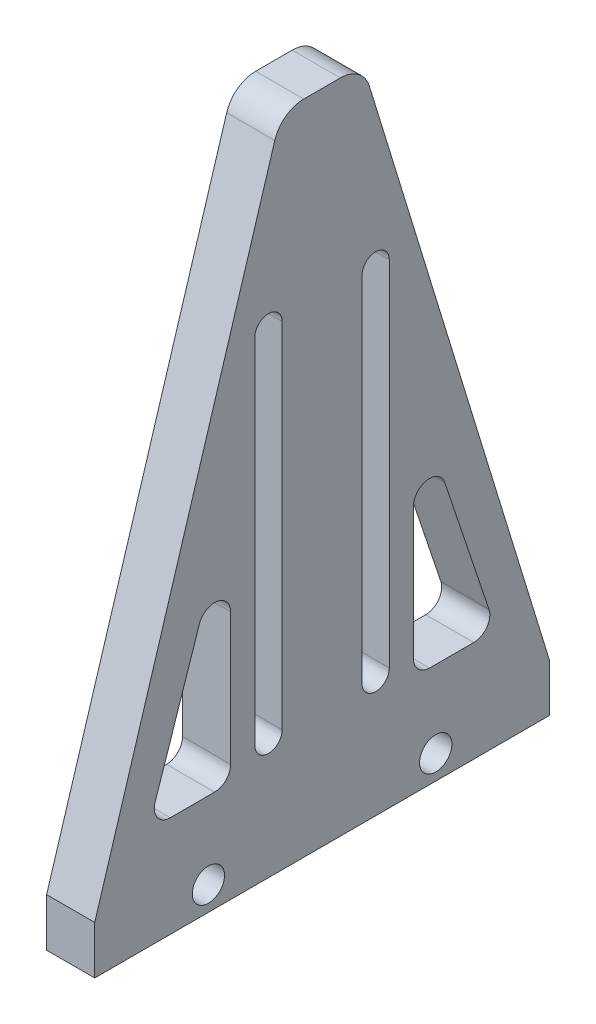
ISO-10303-21;
HEADER;
FILE_DESCRIPTION(('STEP AP214'),'2;1');
FILE_NAME('part.step','',(''),(''),'','','');
FILE_SCHEMA(('AUTOMOTIVE_DESIGN { 1 0 10303 214 1 1 1 1 }'));
ENDSEC;
DATA;
#1=APPLICATION_CONTEXT('core data for automotive mechanical design processes');
#2=APPLICATION_PROTOCOL_DEFINITION('international standard','automotive_design',2000,#1);
#3=PRODUCT_CONTEXT('',#1,'mechanical');
#4=PRODUCT('Part','Part','',(#3));
#5=PRODUCT_RELATED_PRODUCT_CATEGORY('part','',(#4));
#6=PRODUCT_DEFINITION_FORMATION('','',#4);
#7=PRODUCT_DEFINITION_CONTEXT('part definition',#1,'design');
#8=PRODUCT_DEFINITION('design','',#6,#7);
#9=PRODUCT_DEFINITION_SHAPE('','',#8);
#10=(LENGTH_UNIT() NAMED_UNIT(*) SI_UNIT(.MILLI.,.METRE.));
#11=(NAMED_UNIT(*) PLANE_ANGLE_UNIT() SI_UNIT($,.RADIAN.));
#12=(NAMED_UNIT(*) SI_UNIT($,.STERADIAN.) SOLID_ANGLE_UNIT());
#13=UNCERTAINTY_MEASURE_WITH_UNIT(LENGTH_MEASURE(1.E-05),#10,'distance_accuracy_value','');
#14=(GEOMETRIC_REPRESENTATION_CONTEXT(3) GLOBAL_UNCERTAINTY_ASSIGNED_CONTEXT((#13)) GLOBAL_UNIT_ASSIGNED_CONTEXT((#10,
#11,#12)) REPRESENTATION_CONTEXT('',''));
#15=CARTESIAN_POINT('',(0.,0.,0.));
#16=DIRECTION('',(0.,0.,1.));
#17=DIRECTION('',(1.,0.,0.));
#18=AXIS2_PLACEMENT_3D('',#15,#16,#17);
#19=CARTESIAN_POINT('',(2.3815,62.,1.809725066952));
#20=DIRECTION('',(1.,0.,0.));
#21=DIRECTION('',(0.,0.,-1.));
#22=AXIS2_PLACEMENT_3D('',#19,#20,#21);
#23=PLANE('',#22);
#24=CARTESIAN_POINT('',(2.3815,2.38149999999999,11.25));
#25=DIRECTION('',(1.,0.,0.));
#26=DIRECTION('',(0.,0.,-1.));
#27=AXIS2_PLACEMENT_3D('',#24,#25,#26);
#28=CIRCLE('',#27,1.6);
#29=CARTESIAN_POINT('',(2.3815,2.38149999999999,9.65));
#30=VERTEX_POINT('',#29);
#31=EDGE_CURVE('E1065',#30,#30,#28,.T.);
#32=ORIENTED_EDGE('',*,*,#31,.F.);
#33=EDGE_LOOP('',(#32));
#34=FACE_BOUND('',#33,.T.);
#35=CARTESIAN_POINT('',(2.3815,2.38149999999999,-11.25));
#36=DIRECTION('',(1.,0.,0.));
#37=DIRECTION('',(0.,0.,-1.));
#38=AXIS2_PLACEMENT_3D('',#35,#36,#37);
#39=CIRCLE('',#38,1.6);
#40=CARTESIAN_POINT('',(2.3815,2.38149999999999,-12.85));
#41=VERTEX_POINT('',#40);
#42=EDGE_CURVE('E1062',#41,#41,#39,.T.);
#43=ORIENTED_EDGE('',*,*,#42,.F.);
#44=EDGE_LOOP('',(#43));
#45=FACE_BOUND('',#44,.T.);
#46=DIRECTION('',(0.,-0.948109953692156,0.317942629588826));
#47=VECTOR('',#46,1.);
#48=CARTESIAN_POINT('',(2.3815,25.1645764791513,12.1383518735185));
#49=LINE('',#48,#47);
#50=CARTESIAN_POINT('',(2.3815,25.1645764791513,12.1383518735185));
#51=VERTEX_POINT('',#50);
#52=CARTESIAN_POINT('',(2.3815,12.0922339244723,16.5220786243402));
#53=VERTEX_POINT('',#52);
#54=EDGE_CURVE('E782',#51,#53,#49,.T.);
#55=ORIENTED_EDGE('',*,*,#54,.F.);
#56=CARTESIAN_POINT('',(2.3815,24.659842554679,10.6332273220322));
#57=DIRECTION('',(1.,0.,0.));
#58=DIRECTION('',(0.,0.,-1.));
#59=AXIS2_PLACEMENT_3D('',#56,#57,#58);
#60=CIRCLE('',#59,1.5875);
#61=CARTESIAN_POINT('',(2.3815,24.659842554679,9.04572732203224));
#62=VERTEX_POINT('',#61);
#63=EDGE_CURVE('E780',#62,#51,#60,.T.);
#64=ORIENTED_EDGE('',*,*,#63,.F.);
#65=DIRECTION('',(0.,1.,0.));
#66=VECTOR('',#65,1.);
#67=CARTESIAN_POINT('',(2.3815,24.659842554679,9.04572732203224));
#68=LINE('',#67,#66);
#69=CARTESIAN_POINT('',(2.3815,11.5875,9.04572732203223));
#70=VERTEX_POINT('',#69);
#71=EDGE_CURVE('E792',#70,#62,#68,.T.);
#72=ORIENTED_EDGE('',*,*,#71,.F.);
#73=CARTESIAN_POINT('',(2.3815,11.5875,10.6332273220322));
#74=DIRECTION('',(1.,0.,0.));
#75=DIRECTION('',(0.,0.,-1.));
#76=AXIS2_PLACEMENT_3D('',#73,#74,#75);
#77=CIRCLE('',#76,1.5875);
#78=CARTESIAN_POINT('',(2.3815,10.,10.6332273220322));
#79=VERTEX_POINT('',#78);
#80=EDGE_CURVE('E789',#79,#70,#77,.T.);
#81=ORIENTED_EDGE('',*,*,#80,.F.);
#82=DIRECTION('',(0.,0.,-1.));
#83=VECTOR('',#82,1.);
#84=CARTESIAN_POINT('',(2.3815,10.,15.0169540728539));
#85=LINE('',#84,#83);
#86=CARTESIAN_POINT('',(2.3815,10.,15.0169540728539));
#87=VERTEX_POINT('',#86);
#88=EDGE_CURVE('E787',#87,#79,#85,.T.);
#89=ORIENTED_EDGE('',*,*,#88,.F.);
#90=CARTESIAN_POINT('',(2.3815,11.5875,15.0169540728539));
#91=DIRECTION('',(1.,0.,0.));
#92=DIRECTION('',(0.,0.,1.));
#93=AXIS2_PLACEMENT_3D('',#90,#91,#92);
#94=CIRCLE('',#93,1.5875);
#95=EDGE_CURVE('E785',#53,#87,#94,.T.);
#96=ORIENTED_EDGE('',*,*,#95,.F.);
#97=EDGE_LOOP('',(#55,#64,#72,#81,#89,#96));
#98=FACE_BOUND('',#97,.T.);
#99=DIRECTION('',(0.,-1.,0.));
#100=VECTOR('',#99,1.);
#101=CARTESIAN_POINT('',(2.3815,47.,6.6550085664508));
#102=LINE('',#101,#100);
#103=CARTESIAN_POINT('',(2.3815,47.,6.6550085664508));
#104=VERTEX_POINT('',#103);
#105=CARTESIAN_POINT('',(2.3815,12.,6.65500856645079));
#106=VERTEX_POINT('',#105);
#107=EDGE_CURVE('E916',#104,#106,#102,.T.);
#108=ORIENTED_EDGE('',*,*,#107,.F.);
#109=CARTESIAN_POINT('',(2.3815,47.,5.3050085664508));
#110=DIRECTION('',(1.,0.,0.));
#111=DIRECTION('',(0.,0.,-1.));
#112=AXIS2_PLACEMENT_3D('',#109,#110,#111);
#113=CIRCLE('',#112,1.35);
#114=CARTESIAN_POINT('',(2.3815,47.,3.9550085664508));
#115=VERTEX_POINT('',#114);
#116=EDGE_CURVE('E914',#115,#104,#113,.T.);
#117=ORIENTED_EDGE('',*,*,#116,.F.);
#118=DIRECTION('',(0.,1.,0.));
#119=VECTOR('',#118,1.);
#120=CARTESIAN_POINT('',(2.3815,47.,3.9550085664508));
#121=LINE('',#120,#119);
#122=CARTESIAN_POINT('',(2.3815,12.,3.9550085664508));
#123=VERTEX_POINT('',#122);
#124=EDGE_CURVE('E839',#123,#115,#121,.T.);
#125=ORIENTED_EDGE('',*,*,#124,.F.);
#126=CARTESIAN_POINT('',(2.3815,12.,5.30500856645079));
#127=DIRECTION('',(1.,0.,0.));
#128=DIRECTION('',(0.,0.,-1.));
#129=AXIS2_PLACEMENT_3D('',#126,#127,#128);
#130=CIRCLE('',#129,1.35);
#131=EDGE_CURVE('E917',#106,#123,#130,.T.);
#132=ORIENTED_EDGE('',*,*,#131,.F.);
#133=EDGE_LOOP('',(#108,#117,#125,#132));
#134=FACE_BOUND('',#133,.T.);
#135=DIRECTION('',(0.,-1.,0.));
#136=VECTOR('',#135,1.);
#137=CARTESIAN_POINT('',(2.3815,0.,22.5));
#138=LINE('',#137,#136);
#139=CARTESIAN_POINT('',(2.3815,4.763,22.5));
#140=VERTEX_POINT('',#139);
#141=CARTESIAN_POINT('',(2.3815,0.,22.5));
#142=VERTEX_POINT('',#141);
#143=EDGE_CURVE('E936',#140,#142,#138,.T.);
#144=ORIENTED_EDGE('',*,*,#143,.T.);
#145=DIRECTION('',(0.,0.,-1.));
#146=VECTOR('',#145,1.);
#147=CARTESIAN_POINT('',(2.3815,0.,22.5));
#148=LINE('',#147,#146);
#149=CARTESIAN_POINT('',(2.3815,0.,-22.5));
#150=VERTEX_POINT('',#149);
#151=EDGE_CURVE('E939',#142,#150,#148,.T.);
#152=ORIENTED_EDGE('',*,*,#151,.T.);
#153=DIRECTION('',(0.,1.,0.));
#154=VECTOR('',#153,1.);
#155=CARTESIAN_POINT('',(2.3815,0.,-22.5));
#156=LINE('',#155,#154);
#157=CARTESIAN_POINT('',(2.3815,4.763,-22.5));
#158=VERTEX_POINT('',#157);
#159=EDGE_CURVE('E942',#150,#158,#156,.T.);
#160=ORIENTED_EDGE('',*,*,#159,.T.);
#161=DIRECTION('',(0.,0.956055602855064,0.293185409339278));
#162=VECTOR('',#161,1.);
#163=CARTESIAN_POINT('',(2.3815,4.763,-22.5));
#164=LINE('',#163,#162);
#165=CARTESIAN_POINT('',(2.3815,62.8795562280178,-4.6778918755172));
#166=VERTEX_POINT('',#165);
#167=EDGE_CURVE('E944',#158,#166,#164,.T.);
#168=ORIENTED_EDGE('',*,*,#167,.T.);
#169=CARTESIAN_POINT('',(2.3815,62.,-1.809725066952));
#170=DIRECTION('',(1.,0.,0.));
#171=DIRECTION('',(0.,0.,1.));
#172=AXIS2_PLACEMENT_3D('',#169,#170,#171);
#173=CIRCLE('',#172,3.);
#174=CARTESIAN_POINT('',(2.3815,65.,-1.809725066952));
#175=VERTEX_POINT('',#174);
#176=EDGE_CURVE('E946',#166,#175,#173,.T.);
#177=ORIENTED_EDGE('',*,*,#176,.T.);
#178=DIRECTION('',(0.,0.,1.));
#179=VECTOR('',#178,1.);
#180=CARTESIAN_POINT('',(2.3815,65.,1.809725066952));
#181=LINE('',#180,#179);
#182=CARTESIAN_POINT('',(2.3815,65.,1.809725066952));
#183=VERTEX_POINT('',#182);
#184=EDGE_CURVE('E948',#175,#183,#181,.T.);
#185=ORIENTED_EDGE('',*,*,#184,.T.);
#186=CARTESIAN_POINT('',(2.3815,62.,1.809725066952));
#187=DIRECTION('',(1.,0.,0.));
#188=DIRECTION('',(0.,0.,-1.));
#189=AXIS2_PLACEMENT_3D('',#186,#187,#188);
#190=CIRCLE('',#189,3.);
#191=CARTESIAN_POINT('',(2.3815,62.8795562280178,4.6778918755172));
#192=VERTEX_POINT('',#191);
#193=EDGE_CURVE('E949',#183,#192,#190,.T.);
#194=ORIENTED_EDGE('',*,*,#193,.T.);
#195=DIRECTION('',(0.,-0.956055602855064,0.293185409339278));
#196=VECTOR('',#195,1.);
#197=CARTESIAN_POINT('',(2.3815,62.8795562280178,4.6778918755172));
#198=LINE('',#197,#196);
#199=EDGE_CURVE('E867',#192,#140,#198,.T.);
#200=ORIENTED_EDGE('',*,*,#199,.T.);
#201=EDGE_LOOP('',(#144,#152,#160,#168,#177,#185,#194,#200));
#202=FACE_BOUND('',#201,.T.);
#203=DIRECTION('',(0.,-1.,0.));
#204=VECTOR('',#203,1.);
#205=CARTESIAN_POINT('',(2.3815,47.,-3.95500856645079));
#206=LINE('',#205,#204);
#207=CARTESIAN_POINT('',(2.3815,47.,-3.95500856645079));
#208=VERTEX_POINT('',#207);
#209=CARTESIAN_POINT('',(2.3815,12.,-3.95500856645079));
#210=VERTEX_POINT('',#209);
#211=EDGE_CURVE('E1026',#208,#210,#206,.T.);
#212=ORIENTED_EDGE('',*,*,#211,.F.);
#213=CARTESIAN_POINT('',(2.3815,47.,-5.30500856645079));
#214=DIRECTION('',(1.,0.,0.));
#215=DIRECTION('',(0.,0.,-1.));
#216=AXIS2_PLACEMENT_3D('',#213,#214,#215);
#217=CIRCLE('',#216,1.35);
#218=CARTESIAN_POINT('',(2.3815,47.,-6.65500856645079));
#219=VERTEX_POINT('',#218);
#220=EDGE_CURVE('E904',#219,#208,#217,.T.);
#221=ORIENTED_EDGE('',*,*,#220,.F.);
#222=DIRECTION('',(0.,1.,0.));
#223=VECTOR('',#222,1.);
#224=CARTESIAN_POINT('',(2.3815,47.,-6.65500856645079));
#225=LINE('',#224,#223);
#226=CARTESIAN_POINT('',(2.3815,12.,-6.65500856645079));
#227=VERTEX_POINT('',#226);
#228=EDGE_CURVE('E889',#227,#219,#225,.T.);
#229=ORIENTED_EDGE('',*,*,#228,.F.);
#230=CARTESIAN_POINT('',(2.3815,12.,-5.30500856645079));
#231=DIRECTION('',(1.,0.,0.));
#232=DIRECTION('',(0.,0.,-1.));
#233=AXIS2_PLACEMENT_3D('',#230,#231,#232);
#234=CIRCLE('',#233,1.35);
#235=EDGE_CURVE('E1029',#210,#227,#234,.T.);
#236=ORIENTED_EDGE('',*,*,#235,.F.);
#237=EDGE_LOOP('',(#212,#221,#229,#236));
#238=FACE_BOUND('',#237,.T.);
#239=DIRECTION('',(0.,0.948109953692156,0.317942629588826));
#240=VECTOR('',#239,1.);
#241=CARTESIAN_POINT('',(2.3815,25.1645764791513,-12.1383518735185));
#242=LINE('',#241,#240);
#243=CARTESIAN_POINT('',(2.3815,12.0922339244723,-16.5220786243401));
#244=VERTEX_POINT('',#243);
#245=CARTESIAN_POINT('',(2.3815,25.1645764791513,-12.1383518735185));
#246=VERTEX_POINT('',#245);
#247=EDGE_CURVE('E237',#244,#246,#242,.T.);
#248=ORIENTED_EDGE('',*,*,#247,.F.);
#249=CARTESIAN_POINT('',(2.3815,11.5875,-15.0169540728538));
#250=DIRECTION('',(1.,0.,0.));
#251=DIRECTION('',(0.,0.,-1.));
#252=AXIS2_PLACEMENT_3D('',#249,#250,#251);
#253=CIRCLE('',#252,1.5875);
#254=CARTESIAN_POINT('',(2.3815,10.,-15.0169540728538));
#255=VERTEX_POINT('',#254);
#256=EDGE_CURVE('E229',#255,#244,#253,.T.);
#257=ORIENTED_EDGE('',*,*,#256,.F.);
#258=DIRECTION('',(0.,0.,-1.));
#259=VECTOR('',#258,1.);
#260=CARTESIAN_POINT('',(2.3815,10.,-15.0169540728538));
#261=LINE('',#260,#259);
#262=CARTESIAN_POINT('',(2.3815,10.,-10.6332273220322));
#263=VERTEX_POINT('',#262);
#264=EDGE_CURVE('E259',#263,#255,#261,.T.);
#265=ORIENTED_EDGE('',*,*,#264,.F.);
#266=CARTESIAN_POINT('',(2.3815,11.5875,-10.6332273220322));
#267=DIRECTION('',(1.,0.,0.));
#268=DIRECTION('',(0.,0.,1.));
#269=AXIS2_PLACEMENT_3D('',#266,#267,#268);
#270=CIRCLE('',#269,1.5875);
#271=CARTESIAN_POINT('',(2.3815,11.5875,-9.04572732203222));
#272=VERTEX_POINT('',#271);
#273=EDGE_CURVE('E257',#272,#263,#270,.T.);
#274=ORIENTED_EDGE('',*,*,#273,.F.);
#275=DIRECTION('',(0.,-1.,0.));
#276=VECTOR('',#275,1.);
#277=CARTESIAN_POINT('',(2.3815,24.659842554679,-9.04572732203223));
#278=LINE('',#277,#276);
#279=CARTESIAN_POINT('',(2.3815,24.659842554679,-9.04572732203223));
#280=VERTEX_POINT('',#279);
#281=EDGE_CURVE('E252',#280,#272,#278,.T.);
#282=ORIENTED_EDGE('',*,*,#281,.F.);
#283=CARTESIAN_POINT('',(2.3815,24.659842554679,-10.6332273220322));
#284=DIRECTION('',(1.,0.,0.));
#285=DIRECTION('',(0.,0.,1.));
#286=AXIS2_PLACEMENT_3D('',#283,#284,#285);
#287=CIRCLE('',#286,1.5875);
#288=EDGE_CURVE('E250',#246,#280,#287,.T.);
#289=ORIENTED_EDGE('',*,*,#288,.F.);
#290=EDGE_LOOP('',(#248,#257,#265,#274,#282,#289));
#291=FACE_BOUND('',#290,.T.);
#292=ADVANCED_FACE('F44',(#34,#45,#98,#134,#202,#238,#291),#23,.T.);
#293=CARTESIAN_POINT('',(-2.3815,62.,1.809725066952));
#294=DIRECTION('',(1.,0.,0.));
#295=DIRECTION('',(0.,0.,-1.));
#296=AXIS2_PLACEMENT_3D('',#293,#294,#295);
#297=PLANE('',#296);
#298=CARTESIAN_POINT('',(-2.3815,2.38149999999999,11.25));
#299=DIRECTION('',(1.,0.,0.));
#300=DIRECTION('',(0.,0.,-1.));
#301=AXIS2_PLACEMENT_3D('',#298,#299,#300);
#302=CIRCLE('',#301,1.6);
#303=CARTESIAN_POINT('',(-2.3815,2.38149999999999,9.65));
#304=VERTEX_POINT('',#303);
#305=EDGE_CURVE('E1063',#304,#304,#302,.T.);
#306=ORIENTED_EDGE('',*,*,#305,.T.);
#307=EDGE_LOOP('',(#306));
#308=FACE_BOUND('',#307,.T.);
#309=CARTESIAN_POINT('',(-2.3815,2.38149999999999,-11.25));
#310=DIRECTION('',(1.,0.,0.));
#311=DIRECTION('',(0.,0.,-1.));
#312=AXIS2_PLACEMENT_3D('',#309,#310,#311);
#313=CIRCLE('',#312,1.6);
#314=CARTESIAN_POINT('',(-2.3815,2.38149999999999,-12.85));
#315=VERTEX_POINT('',#314);
#316=EDGE_CURVE('E264',#315,#315,#313,.T.);
#317=ORIENTED_EDGE('',*,*,#316,.T.);
#318=EDGE_LOOP('',(#317));
#319=FACE_BOUND('',#318,.T.);
#320=CARTESIAN_POINT('',(-2.3815,24.659842554679,10.6332273220322));
#321=DIRECTION('',(1.,0.,0.));
#322=DIRECTION('',(0.,0.,-1.));
#323=AXIS2_PLACEMENT_3D('',#320,#321,#322);
#324=CIRCLE('',#323,1.5875);
#325=CARTESIAN_POINT('',(-2.3815,24.659842554679,9.04572732203224));
#326=VERTEX_POINT('',#325);
#327=CARTESIAN_POINT('',(-2.3815,25.1645764791513,12.1383518735185));
#328=VERTEX_POINT('',#327);
#329=EDGE_CURVE('E245',#326,#328,#324,.T.);
#330=ORIENTED_EDGE('',*,*,#329,.T.);
#331=DIRECTION('',(0.,-0.948109953692156,0.317942629588826));
#332=VECTOR('',#331,1.);
#333=CARTESIAN_POINT('',(-2.3815,25.1645764791513,12.1383518735185));
#334=LINE('',#333,#332);
#335=CARTESIAN_POINT('',(-2.3815,12.0922339244723,16.5220786243402));
#336=VERTEX_POINT('',#335);
#337=EDGE_CURVE('E799',#328,#336,#334,.T.);
#338=ORIENTED_EDGE('',*,*,#337,.T.);
#339=CARTESIAN_POINT('',(-2.3815,11.5875,15.0169540728539));
#340=DIRECTION('',(1.,0.,0.));
#341=DIRECTION('',(0.,0.,1.));
#342=AXIS2_PLACEMENT_3D('',#339,#340,#341);
#343=CIRCLE('',#342,1.5875);
#344=CARTESIAN_POINT('',(-2.3815,10.,15.0169540728539));
#345=VERTEX_POINT('',#344);
#346=EDGE_CURVE('E810',#336,#345,#343,.T.);
#347=ORIENTED_EDGE('',*,*,#346,.T.);
#348=DIRECTION('',(0.,0.,-1.));
#349=VECTOR('',#348,1.);
#350=CARTESIAN_POINT('',(-2.3815,10.,15.0169540728539));
#351=LINE('',#350,#349);
#352=CARTESIAN_POINT('',(-2.3815,10.,10.6332273220322));
#353=VERTEX_POINT('',#352);
#354=EDGE_CURVE('E814',#345,#353,#351,.T.);
#355=ORIENTED_EDGE('',*,*,#354,.T.);
#356=CARTESIAN_POINT('',(-2.3815,11.5875,10.6332273220322));
#357=DIRECTION('',(1.,0.,0.));
#358=DIRECTION('',(0.,0.,-1.));
#359=AXIS2_PLACEMENT_3D('',#356,#357,#358);
#360=CIRCLE('',#359,1.5875);
#361=CARTESIAN_POINT('',(-2.3815,11.5875,9.04572732203224));
#362=VERTEX_POINT('',#361);
#363=EDGE_CURVE('E819',#353,#362,#360,.T.);
#364=ORIENTED_EDGE('',*,*,#363,.T.);
#365=DIRECTION('',(0.,1.,0.));
#366=VECTOR('',#365,1.);
#367=CARTESIAN_POINT('',(-2.3815,24.659842554679,9.04572732203224));
#368=LINE('',#367,#366);
#369=EDGE_CURVE('E783',#362,#326,#368,.T.);
#370=ORIENTED_EDGE('',*,*,#369,.T.);
#371=EDGE_LOOP('',(#330,#338,#347,#355,#364,#370));
#372=FACE_BOUND('',#371,.T.);
#373=CARTESIAN_POINT('',(-2.3815,47.,5.3050085664508));
#374=DIRECTION('',(1.,0.,0.));
#375=DIRECTION('',(0.,0.,-1.));
#376=AXIS2_PLACEMENT_3D('',#373,#374,#375);
#377=CIRCLE('',#376,1.35);
#378=CARTESIAN_POINT('',(-2.3815,47.,3.9550085664508));
#379=VERTEX_POINT('',#378);
#380=CARTESIAN_POINT('',(-2.3815,47.,6.6550085664508));
#381=VERTEX_POINT('',#380);
#382=EDGE_CURVE('E832',#379,#381,#377,.T.);
#383=ORIENTED_EDGE('',*,*,#382,.T.);
#384=DIRECTION('',(0.,-1.,0.));
#385=VECTOR('',#384,1.);
#386=CARTESIAN_POINT('',(-2.3815,47.,6.6550085664508));
#387=LINE('',#386,#385);
#388=CARTESIAN_POINT('',(-2.3815,12.,6.65500856645079));
#389=VERTEX_POINT('',#388);
#390=EDGE_CURVE('E837',#381,#389,#387,.T.);
#391=ORIENTED_EDGE('',*,*,#390,.T.);
#392=CARTESIAN_POINT('',(-2.3815,12.,5.30500856645079));
#393=DIRECTION('',(1.,0.,0.));
#394=DIRECTION('',(0.,0.,-1.));
#395=AXIS2_PLACEMENT_3D('',#392,#393,#394);
#396=CIRCLE('',#395,1.35);
#397=CARTESIAN_POINT('',(-2.3815,12.,3.9550085664508));
#398=VERTEX_POINT('',#397);
#399=EDGE_CURVE('E845',#389,#398,#396,.T.);
#400=ORIENTED_EDGE('',*,*,#399,.T.);
#401=DIRECTION('',(0.,1.,0.));
#402=VECTOR('',#401,1.);
#403=CARTESIAN_POINT('',(-2.3815,47.,3.9550085664508));
#404=LINE('',#403,#402);
#405=EDGE_CURVE('E850',#398,#379,#404,.T.);
#406=ORIENTED_EDGE('',*,*,#405,.T.);
#407=EDGE_LOOP('',(#383,#391,#400,#406));
#408=FACE_BOUND('',#407,.T.);
#409=DIRECTION('',(0.,-1.,0.));
#410=VECTOR('',#409,1.);
#411=CARTESIAN_POINT('',(-2.3815,0.,22.5));
#412=LINE('',#411,#410);
#413=CARTESIAN_POINT('',(-2.3815,4.763,22.5));
#414=VERTEX_POINT('',#413);
#415=CARTESIAN_POINT('',(-2.3815,0.,22.5));
#416=VERTEX_POINT('',#415);
#417=EDGE_CURVE('E859',#414,#416,#412,.T.);
#418=ORIENTED_EDGE('',*,*,#417,.F.);
#419=DIRECTION('',(0.,-0.956055602855064,0.293185409339278));
#420=VECTOR('',#419,1.);
#421=CARTESIAN_POINT('',(-2.3815,62.8795562280178,4.6778918755172));
#422=LINE('',#421,#420);
#423=CARTESIAN_POINT('',(-2.3815,62.8795562280178,4.6778918755172));
#424=VERTEX_POINT('',#423);
#425=EDGE_CURVE('E940',#424,#414,#422,.T.);
#426=ORIENTED_EDGE('',*,*,#425,.F.);
#427=CARTESIAN_POINT('',(-2.3815,62.,1.809725066952));
#428=DIRECTION('',(1.,0.,0.));
#429=DIRECTION('',(0.,0.,-1.));
#430=AXIS2_PLACEMENT_3D('',#427,#428,#429);
#431=CIRCLE('',#430,3.);
#432=CARTESIAN_POINT('',(-2.3815,65.,1.809725066952));
#433=VERTEX_POINT('',#432);
#434=EDGE_CURVE('E1007',#433,#424,#431,.T.);
#435=ORIENTED_EDGE('',*,*,#434,.F.);
#436=DIRECTION('',(0.,0.,1.));
#437=VECTOR('',#436,1.);
#438=CARTESIAN_POINT('',(-2.3815,65.,1.809725066952));
#439=LINE('',#438,#437);
#440=CARTESIAN_POINT('',(-2.3815,65.,-1.809725066952));
#441=VERTEX_POINT('',#440);
#442=EDGE_CURVE('E998',#441,#433,#439,.T.);
#443=ORIENTED_EDGE('',*,*,#442,.F.);
#444=CARTESIAN_POINT('',(-2.3815,62.,-1.809725066952));
#445=DIRECTION('',(1.,0.,0.));
#446=DIRECTION('',(0.,0.,1.));
#447=AXIS2_PLACEMENT_3D('',#444,#445,#446);
#448=CIRCLE('',#447,3.);
#449=CARTESIAN_POINT('',(-2.3815,62.8795562280178,-4.6778918755172));
#450=VERTEX_POINT('',#449);
#451=EDGE_CURVE('E994',#450,#441,#448,.T.);
#452=ORIENTED_EDGE('',*,*,#451,.F.);
#453=DIRECTION('',(0.,0.956055602855064,0.293185409339278));
#454=VECTOR('',#453,1.);
#455=CARTESIAN_POINT('',(-2.3815,4.763,-22.5));
#456=LINE('',#455,#454);
#457=CARTESIAN_POINT('',(-2.3815,4.763,-22.5));
#458=VERTEX_POINT('',#457);
#459=EDGE_CURVE('E991',#458,#450,#456,.T.);
#460=ORIENTED_EDGE('',*,*,#459,.F.);
#461=DIRECTION('',(0.,1.,0.));
#462=VECTOR('',#461,1.);
#463=CARTESIAN_POINT('',(-2.3815,0.,-22.5));
#464=LINE('',#463,#462);
#465=CARTESIAN_POINT('',(-2.3815,0.,-22.5));
#466=VERTEX_POINT('',#465);
#467=EDGE_CURVE('E872',#466,#458,#464,.T.);
#468=ORIENTED_EDGE('',*,*,#467,.F.);
#469=DIRECTION('',(0.,0.,-1.));
#470=VECTOR('',#469,1.);
#471=CARTESIAN_POINT('',(-2.3815,0.,22.5));
#472=LINE('',#471,#470);
#473=EDGE_CURVE('E865',#416,#466,#472,.T.);
#474=ORIENTED_EDGE('',*,*,#473,.F.);
#475=EDGE_LOOP('',(#418,#426,#435,#443,#452,#460,#468,#474));
#476=FACE_BOUND('',#475,.T.);
#477=CARTESIAN_POINT('',(-2.3815,47.,-5.30500856645079));
#478=DIRECTION('',(1.,0.,0.));
#479=DIRECTION('',(0.,0.,-1.));
#480=AXIS2_PLACEMENT_3D('',#477,#478,#479);
#481=CIRCLE('',#480,1.35);
#482=CARTESIAN_POINT('',(-2.3815,47.,-6.65500856645079));
#483=VERTEX_POINT('',#482);
#484=CARTESIAN_POINT('',(-2.3815,47.,-3.95500856645079));
#485=VERTEX_POINT('',#484);
#486=EDGE_CURVE('E882',#483,#485,#481,.T.);
#487=ORIENTED_EDGE('',*,*,#486,.T.);
#488=DIRECTION('',(0.,-1.,0.));
#489=VECTOR('',#488,1.);
#490=CARTESIAN_POINT('',(-2.3815,47.,-3.95500856645079));
#491=LINE('',#490,#489);
#492=CARTESIAN_POINT('',(-2.3815,12.,-3.95500856645079));
#493=VERTEX_POINT('',#492);
#494=EDGE_CURVE('E887',#485,#493,#491,.T.);
#495=ORIENTED_EDGE('',*,*,#494,.T.);
#496=CARTESIAN_POINT('',(-2.3815,12.,-5.30500856645079));
#497=DIRECTION('',(1.,0.,0.));
#498=DIRECTION('',(0.,0.,-1.));
#499=AXIS2_PLACEMENT_3D('',#496,#497,#498);
#500=CIRCLE('',#499,1.35);
#501=CARTESIAN_POINT('',(-2.3815,12.,-6.65500856645079));
#502=VERTEX_POINT('',#501);
#503=EDGE_CURVE('E895',#493,#502,#500,.T.);
#504=ORIENTED_EDGE('',*,*,#503,.T.);
#505=DIRECTION('',(0.,1.,0.));
#506=VECTOR('',#505,1.);
#507=CARTESIAN_POINT('',(-2.3815,47.,-6.65500856645079));
#508=LINE('',#507,#506);
#509=EDGE_CURVE('E899',#502,#483,#508,.T.);
#510=ORIENTED_EDGE('',*,*,#509,.T.);
#511=EDGE_LOOP('',(#487,#495,#504,#510));
#512=FACE_BOUND('',#511,.T.);
#513=CARTESIAN_POINT('',(-2.3815,11.5875,-15.0169540728538));
#514=DIRECTION('',(1.,0.,0.));
#515=DIRECTION('',(0.,0.,-1.));
#516=AXIS2_PLACEMENT_3D('',#513,#514,#515);
#517=CIRCLE('',#516,1.5875);
#518=CARTESIAN_POINT('',(-2.3815,10.,-15.0169540728538));
#519=VERTEX_POINT('',#518);
#520=CARTESIAN_POINT('',(-2.3815,12.0922339244723,-16.5220786243401));
#521=VERTEX_POINT('',#520);
#522=EDGE_CURVE('E67',#519,#521,#517,.T.);
#523=ORIENTED_EDGE('',*,*,#522,.T.);
#524=DIRECTION('',(0.,0.948109953692156,0.317942629588826));
#525=VECTOR('',#524,1.);
#526=CARTESIAN_POINT('',(-2.3815,25.1645764791513,-12.1383518735185));
#527=LINE('',#526,#525);
#528=CARTESIAN_POINT('',(-2.3815,25.1645764791513,-12.1383518735185));
#529=VERTEX_POINT('',#528);
#530=EDGE_CURVE('E244',#521,#529,#527,.T.);
#531=ORIENTED_EDGE('',*,*,#530,.T.);
#532=CARTESIAN_POINT('',(-2.3815,24.659842554679,-10.6332273220322));
#533=DIRECTION('',(1.,0.,0.));
#534=DIRECTION('',(0.,0.,1.));
#535=AXIS2_PLACEMENT_3D('',#532,#533,#534);
#536=CIRCLE('',#535,1.5875);
#537=CARTESIAN_POINT('',(-2.3815,24.659842554679,-9.04572732203223));
#538=VERTEX_POINT('',#537);
#539=EDGE_CURVE('E276',#529,#538,#536,.T.);
#540=ORIENTED_EDGE('',*,*,#539,.T.);
#541=DIRECTION('',(0.,-1.,0.));
#542=VECTOR('',#541,1.);
#543=CARTESIAN_POINT('',(-2.3815,24.659842554679,-9.04572732203223));
#544=LINE('',#543,#542);
#545=CARTESIAN_POINT('',(-2.3815,11.5875,-9.04572732203222));
#546=VERTEX_POINT('',#545);
#547=EDGE_CURVE('E280',#538,#546,#544,.T.);
#548=ORIENTED_EDGE('',*,*,#547,.T.);
#549=CARTESIAN_POINT('',(-2.3815,11.5875,-10.6332273220322));
#550=DIRECTION('',(1.,0.,0.));
#551=DIRECTION('',(0.,0.,1.));
#552=AXIS2_PLACEMENT_3D('',#549,#550,#551);
#553=CIRCLE('',#552,1.5875);
#554=CARTESIAN_POINT('',(-2.3815,10.,-10.6332273220322));
#555=VERTEX_POINT('',#554);
#556=EDGE_CURVE('E285',#546,#555,#553,.T.);
#557=ORIENTED_EDGE('',*,*,#556,.T.);
#558=DIRECTION('',(0.,0.,-1.));
#559=VECTOR('',#558,1.);
#560=CARTESIAN_POINT('',(-2.3815,10.,-15.0169540728538));
#561=LINE('',#560,#559);
#562=EDGE_CURVE('E238',#555,#519,#561,.T.);
#563=ORIENTED_EDGE('',*,*,#562,.T.);
#564=EDGE_LOOP('',(#523,#531,#540,#548,#557,#563));
#565=FACE_BOUND('',#564,.T.);
#566=ADVANCED_FACE('F988',(#308,#319,#372,#408,#476,#512,#565),#297,.F.);
#567=CARTESIAN_POINT('',(2.3815,0.,22.5));
#568=DIRECTION('',(0.,0.,-1.));
#569=DIRECTION('',(0.,1.,0.));
#570=AXIS2_PLACEMENT_3D('',#567,#568,#569);
#571=PLANE('',#570);
#572=ORIENTED_EDGE('',*,*,#417,.T.);
#573=DIRECTION('',(-1.,0.,0.));
#574=VECTOR('',#573,1.);
#575=CARTESIAN_POINT('',(2.3815,0.,22.5));
#576=LINE('',#575,#574);
#577=EDGE_CURVE('E12',#142,#416,#576,.T.);
#578=ORIENTED_EDGE('',*,*,#577,.F.);
#579=ORIENTED_EDGE('',*,*,#143,.F.);
#580=DIRECTION('',(-1.,0.,0.));
#581=VECTOR('',#580,1.);
#582=CARTESIAN_POINT('',(2.3815,4.763,22.5));
#583=LINE('',#582,#581);
#584=EDGE_CURVE('E953',#140,#414,#583,.T.);
#585=ORIENTED_EDGE('',*,*,#584,.T.);
#586=EDGE_LOOP('',(#572,#578,#579,#585));
#587=FACE_BOUND('',#586,.T.);
#588=ADVANCED_FACE('F46',(#587),#571,.F.);
#589=CARTESIAN_POINT('',(2.3815,0.,22.5));
#590=DIRECTION('',(0.,1.,0.));
#591=DIRECTION('',(0.,0.,1.));
#592=AXIS2_PLACEMENT_3D('',#589,#590,#591);
#593=PLANE('',#592);
#594=ORIENTED_EDGE('',*,*,#473,.T.);
#595=DIRECTION('',(-1.,0.,0.));
#596=VECTOR('',#595,1.);
#597=CARTESIAN_POINT('',(2.3815,0.,-22.5));
#598=LINE('',#597,#596);
#599=EDGE_CURVE('E52',#150,#466,#598,.T.);
#600=ORIENTED_EDGE('',*,*,#599,.F.);
#601=ORIENTED_EDGE('',*,*,#151,.F.);
#602=ORIENTED_EDGE('',*,*,#577,.T.);
#603=EDGE_LOOP('',(#594,#600,#601,#602));
#604=FACE_BOUND('',#603,.T.);
#605=ADVANCED_FACE('F1018',(#604),#593,.F.);
#606=CARTESIAN_POINT('',(2.3815,0.,-22.5));
#607=DIRECTION('',(0.,0.,1.));
#608=DIRECTION('',(1.,0.,0.));
#609=AXIS2_PLACEMENT_3D('',#606,#607,#608);
#610=PLANE('',#609);
#611=ORIENTED_EDGE('',*,*,#467,.T.);
#612=DIRECTION('',(-1.,0.,0.));
#613=VECTOR('',#612,1.);
#614=CARTESIAN_POINT('',(2.3815,4.763,-22.5));
#615=LINE('',#614,#613);
#616=EDGE_CURVE('E976',#158,#458,#615,.T.);
#617=ORIENTED_EDGE('',*,*,#616,.F.);
#618=ORIENTED_EDGE('',*,*,#159,.F.);
#619=ORIENTED_EDGE('',*,*,#599,.T.);
#620=EDGE_LOOP('',(#611,#617,#618,#619));
#621=FACE_BOUND('',#620,.T.);
#622=ADVANCED_FACE('F983',(#621),#610,.F.);
#623=CARTESIAN_POINT('',(2.3815,4.763,-22.5));
#624=DIRECTION('',(0.,-0.293185409339278,0.956055602855064));
#625=DIRECTION('',(0.,-0.956055602855064,-0.293185409339278));
#626=AXIS2_PLACEMENT_3D('',#623,#624,#625);
#627=PLANE('',#626);
#628=ORIENTED_EDGE('',*,*,#459,.T.);
#629=DIRECTION('',(-1.,0.,0.));
#630=VECTOR('',#629,1.);
#631=CARTESIAN_POINT('',(2.3815,62.8795562280178,-4.6778918755172));
#632=LINE('',#631,#630);
#633=EDGE_CURVE('E973',#166,#450,#632,.T.);
#634=ORIENTED_EDGE('',*,*,#633,.F.);
#635=ORIENTED_EDGE('',*,*,#167,.F.);
#636=ORIENTED_EDGE('',*,*,#616,.T.);
#637=EDGE_LOOP('',(#628,#634,#635,#636));
#638=FACE_BOUND('',#637,.T.);
#639=ADVANCED_FACE('F1235',(#638),#627,.F.);
#640=CARTESIAN_POINT('',(2.3815,62.,-1.809725066952));
#641=DIRECTION('',(-1.,0.,0.));
#642=DIRECTION('',(0.,0.,1.));
#643=AXIS2_PLACEMENT_3D('',#640,#641,#642);
#644=CYLINDRICAL_SURFACE('',#643,3.);
#645=ORIENTED_EDGE('',*,*,#451,.T.);
#646=DIRECTION('',(-1.,0.,0.));
#647=VECTOR('',#646,1.);
#648=CARTESIAN_POINT('',(2.3815,65.,-1.809725066952));
#649=LINE('',#648,#647);
#650=EDGE_CURVE('E970',#175,#441,#649,.T.);
#651=ORIENTED_EDGE('',*,*,#650,.F.);
#652=ORIENTED_EDGE('',*,*,#176,.F.);
#653=ORIENTED_EDGE('',*,*,#633,.T.);
#654=EDGE_LOOP('',(#645,#651,#652,#653));
#655=FACE_BOUND('',#654,.T.);
#656=ADVANCED_FACE('F1231',(#655),#644,.T.);
#657=CARTESIAN_POINT('',(2.3815,65.,1.809725066952));
#658=DIRECTION('',(0.,-1.,0.));
#659=DIRECTION('',(0.,0.,-1.));
#660=AXIS2_PLACEMENT_3D('',#657,#658,#659);
#661=PLANE('',#660);
#662=ORIENTED_EDGE('',*,*,#442,.T.);
#663=DIRECTION('',(-1.,0.,0.));
#664=VECTOR('',#663,1.);
#665=CARTESIAN_POINT('',(2.3815,65.,1.809725066952));
#666=LINE('',#665,#664);
#667=EDGE_CURVE('E963',#183,#433,#666,.T.);
#668=ORIENTED_EDGE('',*,*,#667,.F.);
#669=ORIENTED_EDGE('',*,*,#184,.F.);
#670=ORIENTED_EDGE('',*,*,#650,.T.);
#671=EDGE_LOOP('',(#662,#668,#669,#670));
#672=FACE_BOUND('',#671,.T.);
#673=ADVANCED_FACE('F1228',(#672),#661,.F.);
#674=CARTESIAN_POINT('',(2.3815,62.,1.809725066952));
#675=DIRECTION('',(-1.,0.,0.));
#676=DIRECTION('',(0.,0.,1.));
#677=AXIS2_PLACEMENT_3D('',#674,#675,#676);
#678=CYLINDRICAL_SURFACE('',#677,3.);
#679=ORIENTED_EDGE('',*,*,#434,.T.);
#680=DIRECTION('',(-1.,0.,0.));
#681=VECTOR('',#680,1.);
#682=CARTESIAN_POINT('',(2.3815,62.8795562280178,4.6778918755172));
#683=LINE('',#682,#681);
#684=EDGE_CURVE('E957',#192,#424,#683,.T.);
#685=ORIENTED_EDGE('',*,*,#684,.F.);
#686=ORIENTED_EDGE('',*,*,#193,.F.);
#687=ORIENTED_EDGE('',*,*,#667,.T.);
#688=EDGE_LOOP('',(#679,#685,#686,#687));
#689=FACE_BOUND('',#688,.T.);
#690=ADVANCED_FACE('F1220',(#689),#678,.T.);
#691=CARTESIAN_POINT('',(2.3815,62.8795562280178,4.6778918755172));
#692=DIRECTION('',(0.,-0.293185409339278,-0.956055602855064));
#693=DIRECTION('',(0.,0.956055602855064,-0.293185409339278));
#694=AXIS2_PLACEMENT_3D('',#691,#692,#693);
#695=PLANE('',#694);
#696=ORIENTED_EDGE('',*,*,#425,.T.);
#697=ORIENTED_EDGE('',*,*,#584,.F.);
#698=ORIENTED_EDGE('',*,*,#199,.F.);
#699=ORIENTED_EDGE('',*,*,#684,.T.);
#700=EDGE_LOOP('',(#696,#697,#698,#699));
#701=FACE_BOUND('',#700,.T.);
#702=ADVANCED_FACE('F1015',(#701),#695,.F.);
#703=CARTESIAN_POINT('',(2.3815,47.,5.3050085664508));
#704=DIRECTION('',(-1.,0.,0.));
#705=DIRECTION('',(0.,0.,1.));
#706=AXIS2_PLACEMENT_3D('',#703,#704,#705);
#707=CYLINDRICAL_SURFACE('',#706,1.35);
#708=ORIENTED_EDGE('',*,*,#382,.F.);
#709=DIRECTION('',(-1.,0.,0.));
#710=VECTOR('',#709,1.);
#711=CARTESIAN_POINT('',(2.3815,47.,3.9550085664508));
#712=LINE('',#711,#710);
#713=EDGE_CURVE('E923',#115,#379,#712,.T.);
#714=ORIENTED_EDGE('',*,*,#713,.F.);
#715=ORIENTED_EDGE('',*,*,#116,.T.);
#716=DIRECTION('',(-1.,0.,0.));
#717=VECTOR('',#716,1.);
#718=CARTESIAN_POINT('',(2.3815,47.,6.6550085664508));
#719=LINE('',#718,#717);
#720=EDGE_CURVE('E866',#104,#381,#719,.T.);
#721=ORIENTED_EDGE('',*,*,#720,.T.);
#722=EDGE_LOOP('',(#708,#714,#715,#721));
#723=FACE_BOUND('',#722,.T.);
#724=ADVANCED_FACE('F1212',(#723),#707,.F.);
#725=CARTESIAN_POINT('',(2.3815,47.,6.6550085664508));
#726=DIRECTION('',(0.,0.,-1.));
#727=DIRECTION('',(-1.,0.,0.));
#728=AXIS2_PLACEMENT_3D('',#725,#726,#727);
#729=PLANE('',#728);
#730=ORIENTED_EDGE('',*,*,#390,.F.);
#731=ORIENTED_EDGE('',*,*,#720,.F.);
#732=ORIENTED_EDGE('',*,*,#107,.T.);
#733=DIRECTION('',(-1.,0.,0.));
#734=VECTOR('',#733,1.);
#735=CARTESIAN_POINT('',(2.3815,12.,6.65500856645079));
#736=LINE('',#735,#734);
#737=EDGE_CURVE('E930',#106,#389,#736,.T.);
#738=ORIENTED_EDGE('',*,*,#737,.T.);
#739=EDGE_LOOP('',(#730,#731,#732,#738));
#740=FACE_BOUND('',#739,.T.);
#741=ADVANCED_FACE('F1208',(#740),#729,.T.);
#742=CARTESIAN_POINT('',(2.3815,12.,5.30500856645079));
#743=DIRECTION('',(-1.,0.,0.));
#744=DIRECTION('',(0.,0.,1.));
#745=AXIS2_PLACEMENT_3D('',#742,#743,#744);
#746=CYLINDRICAL_SURFACE('',#745,1.35);
#747=ORIENTED_EDGE('',*,*,#399,.F.);
#748=ORIENTED_EDGE('',*,*,#737,.F.);
#749=ORIENTED_EDGE('',*,*,#131,.T.);
#750=DIRECTION('',(-1.,0.,0.));
#751=VECTOR('',#750,1.);
#752=CARTESIAN_POINT('',(2.3815,12.,3.9550085664508));
#753=LINE('',#752,#751);
#754=EDGE_CURVE('E927',#123,#398,#753,.T.);
#755=ORIENTED_EDGE('',*,*,#754,.T.);
#756=EDGE_LOOP('',(#747,#748,#749,#755));
#757=FACE_BOUND('',#756,.T.);
#758=ADVANCED_FACE('F1210',(#757),#746,.F.);
#759=CARTESIAN_POINT('',(2.3815,47.,3.9550085664508));
#760=DIRECTION('',(0.,0.,1.));
#761=DIRECTION('',(1.,0.,0.));
#762=AXIS2_PLACEMENT_3D('',#759,#760,#761);
#763=PLANE('',#762);
#764=ORIENTED_EDGE('',*,*,#405,.F.);
#765=ORIENTED_EDGE('',*,*,#754,.F.);
#766=ORIENTED_EDGE('',*,*,#124,.T.);
#767=ORIENTED_EDGE('',*,*,#713,.T.);
#768=EDGE_LOOP('',(#764,#765,#766,#767));
#769=FACE_BOUND('',#768,.T.);
#770=ADVANCED_FACE('F1339',(#769),#763,.T.);
#771=CARTESIAN_POINT('',(2.3815,47.,-5.30500856645079));
#772=DIRECTION('',(-1.,0.,0.));
#773=DIRECTION('',(0.,0.,1.));
#774=AXIS2_PLACEMENT_3D('',#771,#772,#773);
#775=CYLINDRICAL_SURFACE('',#774,1.35);
#776=ORIENTED_EDGE('',*,*,#486,.F.);
#777=DIRECTION('',(-1.,0.,0.));
#778=VECTOR('',#777,1.);
#779=CARTESIAN_POINT('',(2.3815,47.,-6.65500856645079));
#780=LINE('',#779,#778);
#781=EDGE_CURVE('E905',#219,#483,#780,.T.);
#782=ORIENTED_EDGE('',*,*,#781,.F.);
#783=ORIENTED_EDGE('',*,*,#220,.T.);
#784=DIRECTION('',(-1.,0.,0.));
#785=VECTOR('',#784,1.);
#786=CARTESIAN_POINT('',(2.3815,47.,-3.95500856645079));
#787=LINE('',#786,#785);
#788=EDGE_CURVE('E838',#208,#485,#787,.T.);
#789=ORIENTED_EDGE('',*,*,#788,.T.);
#790=EDGE_LOOP('',(#776,#782,#783,#789));
#791=FACE_BOUND('',#790,.T.);
#792=ADVANCED_FACE('F1336',(#791),#775,.F.);
#793=CARTESIAN_POINT('',(2.3815,47.,-3.95500856645079));
#794=DIRECTION('',(0.,0.,-1.));
#795=DIRECTION('',(-1.,0.,0.));
#796=AXIS2_PLACEMENT_3D('',#793,#794,#795);
#797=PLANE('',#796);
#798=ORIENTED_EDGE('',*,*,#494,.F.);
#799=ORIENTED_EDGE('',*,*,#788,.F.);
#800=ORIENTED_EDGE('',*,*,#211,.T.);
#801=DIRECTION('',(-1.,0.,0.));
#802=VECTOR('',#801,1.);
#803=CARTESIAN_POINT('',(2.3815,12.,-3.95500856645079));
#804=LINE('',#803,#802);
#805=EDGE_CURVE('E910',#210,#493,#804,.T.);
#806=ORIENTED_EDGE('',*,*,#805,.T.);
#807=EDGE_LOOP('',(#798,#799,#800,#806));
#808=FACE_BOUND('',#807,.T.);
#809=ADVANCED_FACE('F1332',(#808),#797,.T.);
#810=CARTESIAN_POINT('',(2.3815,12.,-5.30500856645079));
#811=DIRECTION('',(-1.,0.,0.));
#812=DIRECTION('',(0.,0.,1.));
#813=AXIS2_PLACEMENT_3D('',#810,#811,#812);
#814=CYLINDRICAL_SURFACE('',#813,1.35);
#815=ORIENTED_EDGE('',*,*,#503,.F.);
#816=ORIENTED_EDGE('',*,*,#805,.F.);
#817=ORIENTED_EDGE('',*,*,#235,.T.);
#818=DIRECTION('',(-1.,0.,0.));
#819=VECTOR('',#818,1.);
#820=CARTESIAN_POINT('',(2.3815,12.,-6.65500856645079));
#821=LINE('',#820,#819);
#822=EDGE_CURVE('E908',#227,#502,#821,.T.);
#823=ORIENTED_EDGE('',*,*,#822,.T.);
#824=EDGE_LOOP('',(#815,#816,#817,#823));
#825=FACE_BOUND('',#824,.T.);
#826=ADVANCED_FACE('F1328',(#825),#814,.F.);
#827=CARTESIAN_POINT('',(2.3815,47.,-6.65500856645079));
#828=DIRECTION('',(0.,0.,1.));
#829=DIRECTION('',(1.,0.,0.));
#830=AXIS2_PLACEMENT_3D('',#827,#828,#829);
#831=PLANE('',#830);
#832=ORIENTED_EDGE('',*,*,#509,.F.);
#833=ORIENTED_EDGE('',*,*,#822,.F.);
#834=ORIENTED_EDGE('',*,*,#228,.T.);
#835=ORIENTED_EDGE('',*,*,#781,.T.);
#836=EDGE_LOOP('',(#832,#833,#834,#835));
#837=FACE_BOUND('',#836,.T.);
#838=ADVANCED_FACE('F1325',(#837),#831,.T.);
#839=CARTESIAN_POINT('',(2.3815,24.659842554679,10.6332273220322));
#840=DIRECTION('',(-1.,0.,0.));
#841=DIRECTION('',(0.,0.,1.));
#842=AXIS2_PLACEMENT_3D('',#839,#840,#841);
#843=CYLINDRICAL_SURFACE('',#842,1.5875);
#844=ORIENTED_EDGE('',*,*,#329,.F.);
#845=DIRECTION('',(-1.,0.,0.));
#846=VECTOR('',#845,1.);
#847=CARTESIAN_POINT('',(2.3815,24.659842554679,9.04572732203224));
#848=LINE('',#847,#846);
#849=EDGE_CURVE('E794',#62,#326,#848,.T.);
#850=ORIENTED_EDGE('',*,*,#849,.F.);
#851=ORIENTED_EDGE('',*,*,#63,.T.);
#852=DIRECTION('',(-1.,0.,0.));
#853=VECTOR('',#852,1.);
#854=CARTESIAN_POINT('',(2.3815,25.1645764791513,12.1383518735185));
#855=LINE('',#854,#853);
#856=EDGE_CURVE('E888',#51,#328,#855,.T.);
#857=ORIENTED_EDGE('',*,*,#856,.T.);
#858=EDGE_LOOP('',(#844,#850,#851,#857));
#859=FACE_BOUND('',#858,.T.);
#860=ADVANCED_FACE('F1321',(#859),#843,.F.);
#861=CARTESIAN_POINT('',(2.3815,25.1645764791513,12.1383518735185));
#862=DIRECTION('',(0.,-0.317942629588826,-0.948109953692156));
#863=DIRECTION('',(0.,0.948109953692156,-0.317942629588826));
#864=AXIS2_PLACEMENT_3D('',#861,#862,#863);
#865=PLANE('',#864);
#866=ORIENTED_EDGE('',*,*,#337,.F.);
#867=ORIENTED_EDGE('',*,*,#856,.F.);
#868=ORIENTED_EDGE('',*,*,#54,.T.);
#869=DIRECTION('',(-1.,0.,0.));
#870=VECTOR('',#869,1.);
#871=CARTESIAN_POINT('',(2.3815,12.0922339244723,16.5220786243402));
#872=LINE('',#871,#870);
#873=EDGE_CURVE('E1038',#53,#336,#872,.T.);
#874=ORIENTED_EDGE('',*,*,#873,.T.);
#875=EDGE_LOOP('',(#866,#867,#868,#874));
#876=FACE_BOUND('',#875,.T.);
#877=ADVANCED_FACE('F1317',(#876),#865,.T.);
#878=CARTESIAN_POINT('',(2.3815,11.5875,15.0169540728539));
#879=DIRECTION('',(-1.,0.,0.));
#880=DIRECTION('',(0.,0.,1.));
#881=AXIS2_PLACEMENT_3D('',#878,#879,#880);
#882=CYLINDRICAL_SURFACE('',#881,1.5875);
#883=ORIENTED_EDGE('',*,*,#346,.F.);
#884=ORIENTED_EDGE('',*,*,#873,.F.);
#885=ORIENTED_EDGE('',*,*,#95,.T.);
#886=DIRECTION('',(-1.,0.,0.));
#887=VECTOR('',#886,1.);
#888=CARTESIAN_POINT('',(2.3815,10.,15.0169540728539));
#889=LINE('',#888,#887);
#890=EDGE_CURVE('E1040',#87,#345,#889,.T.);
#891=ORIENTED_EDGE('',*,*,#890,.T.);
#892=EDGE_LOOP('',(#883,#884,#885,#891));
#893=FACE_BOUND('',#892,.T.);
#894=ADVANCED_FACE('F1313',(#893),#882,.F.);
#895=CARTESIAN_POINT('',(2.3815,10.,15.0169540728539));
#896=DIRECTION('',(0.,1.,0.));
#897=DIRECTION('',(0.,0.,1.));
#898=AXIS2_PLACEMENT_3D('',#895,#896,#897);
#899=PLANE('',#898);
#900=ORIENTED_EDGE('',*,*,#354,.F.);
#901=ORIENTED_EDGE('',*,*,#890,.F.);
#902=ORIENTED_EDGE('',*,*,#88,.T.);
#903=DIRECTION('',(-1.,0.,0.));
#904=VECTOR('',#903,1.);
#905=CARTESIAN_POINT('',(2.3815,10.,10.6332273220322));
#906=LINE('',#905,#904);
#907=EDGE_CURVE('E1042',#79,#353,#906,.T.);
#908=ORIENTED_EDGE('',*,*,#907,.T.);
#909=EDGE_LOOP('',(#900,#901,#902,#908));
#910=FACE_BOUND('',#909,.T.);
#911=ADVANCED_FACE('F1309',(#910),#899,.T.);
#912=CARTESIAN_POINT('',(2.3815,11.5875,10.6332273220322));
#913=DIRECTION('',(-1.,0.,0.));
#914=DIRECTION('',(0.,0.,1.));
#915=AXIS2_PLACEMENT_3D('',#912,#913,#914);
#916=CYLINDRICAL_SURFACE('',#915,1.5875);
#917=ORIENTED_EDGE('',*,*,#363,.F.);
#918=ORIENTED_EDGE('',*,*,#907,.F.);
#919=ORIENTED_EDGE('',*,*,#80,.T.);
#920=DIRECTION('',(-1.,0.,0.));
#921=VECTOR('',#920,1.);
#922=CARTESIAN_POINT('',(2.3815,11.5875,9.04572732203224));
#923=LINE('',#922,#921);
#924=EDGE_CURVE('E1044',#70,#362,#923,.T.);
#925=ORIENTED_EDGE('',*,*,#924,.T.);
#926=EDGE_LOOP('',(#917,#918,#919,#925));
#927=FACE_BOUND('',#926,.T.);
#928=ADVANCED_FACE('F1306',(#927),#916,.F.);
#929=CARTESIAN_POINT('',(2.3815,24.659842554679,9.04572732203224));
#930=DIRECTION('',(0.,0.,1.));
#931=DIRECTION('',(0.,-1.,0.));
#932=AXIS2_PLACEMENT_3D('',#929,#930,#931);
#933=PLANE('',#932);
#934=ORIENTED_EDGE('',*,*,#369,.F.);
#935=ORIENTED_EDGE('',*,*,#924,.F.);
#936=ORIENTED_EDGE('',*,*,#71,.T.);
#937=ORIENTED_EDGE('',*,*,#849,.T.);
#938=EDGE_LOOP('',(#934,#935,#936,#937));
#939=FACE_BOUND('',#938,.T.);
#940=ADVANCED_FACE('F1050',(#939),#933,.T.);
#941=CARTESIAN_POINT('',(2.3815,11.5875,-15.0169540728538));
#942=DIRECTION('',(-1.,0.,0.));
#943=DIRECTION('',(0.,0.,1.));
#944=AXIS2_PLACEMENT_3D('',#941,#942,#943);
#945=CYLINDRICAL_SURFACE('',#944,1.5875);
#946=ORIENTED_EDGE('',*,*,#522,.F.);
#947=DIRECTION('',(-1.,0.,0.));
#948=VECTOR('',#947,1.);
#949=CARTESIAN_POINT('',(2.3815,10.,-15.0169540728538));
#950=LINE('',#949,#948);
#951=EDGE_CURVE('E233',#255,#519,#950,.T.);
#952=ORIENTED_EDGE('',*,*,#951,.F.);
#953=ORIENTED_EDGE('',*,*,#256,.T.);
#954=DIRECTION('',(-1.,0.,0.));
#955=VECTOR('',#954,1.);
#956=CARTESIAN_POINT('',(2.3815,12.0922339244723,-16.5220786243401));
#957=LINE('',#956,#955);
#958=EDGE_CURVE('E232',#244,#521,#957,.T.);
#959=ORIENTED_EDGE('',*,*,#958,.T.);
#960=EDGE_LOOP('',(#946,#952,#953,#959));
#961=FACE_BOUND('',#960,.T.);
#962=ADVANCED_FACE('F231',(#961),#945,.F.);
#963=CARTESIAN_POINT('',(2.3815,25.1645764791513,-12.1383518735185));
#964=DIRECTION('',(0.,-0.317942629588826,0.948109953692156));
#965=DIRECTION('',(0.,-0.948109953692156,-0.317942629588826));
#966=AXIS2_PLACEMENT_3D('',#963,#964,#965);
#967=PLANE('',#966);
#968=ORIENTED_EDGE('',*,*,#530,.F.);
#969=ORIENTED_EDGE('',*,*,#958,.F.);
#970=ORIENTED_EDGE('',*,*,#247,.T.);
#971=DIRECTION('',(-1.,0.,0.));
#972=VECTOR('',#971,1.);
#973=CARTESIAN_POINT('',(2.3815,25.1645764791513,-12.1383518735185));
#974=LINE('',#973,#972);
#975=EDGE_CURVE('E246',#246,#529,#974,.T.);
#976=ORIENTED_EDGE('',*,*,#975,.T.);
#977=EDGE_LOOP('',(#968,#969,#970,#976));
#978=FACE_BOUND('',#977,.T.);
#979=ADVANCED_FACE('F241',(#978),#967,.T.);
#980=CARTESIAN_POINT('',(2.3815,24.659842554679,-10.6332273220322));
#981=DIRECTION('',(-1.,0.,0.));
#982=DIRECTION('',(0.,0.,1.));
#983=AXIS2_PLACEMENT_3D('',#980,#981,#982);
#984=CYLINDRICAL_SURFACE('',#983,1.5875);
#985=ORIENTED_EDGE('',*,*,#539,.F.);
#986=ORIENTED_EDGE('',*,*,#975,.F.);
#987=ORIENTED_EDGE('',*,*,#288,.T.);
#988=DIRECTION('',(-1.,0.,0.));
#989=VECTOR('',#988,1.);
#990=CARTESIAN_POINT('',(2.3815,24.659842554679,-9.04572732203223));
#991=LINE('',#990,#989);
#992=EDGE_CURVE('E777',#280,#538,#991,.T.);
#993=ORIENTED_EDGE('',*,*,#992,.T.);
#994=EDGE_LOOP('',(#985,#986,#987,#993));
#995=FACE_BOUND('',#994,.T.);
#996=ADVANCED_FACE('F1295',(#995),#984,.F.);
#997=CARTESIAN_POINT('',(2.3815,24.659842554679,-9.04572732203223));
#998=DIRECTION('',(0.,0.,-1.));
#999=DIRECTION('',(0.,1.,0.));
#1000=AXIS2_PLACEMENT_3D('',#997,#998,#999);
#1001=PLANE('',#1000);
#1002=ORIENTED_EDGE('',*,*,#547,.F.);
#1003=ORIENTED_EDGE('',*,*,#992,.F.);
#1004=ORIENTED_EDGE('',*,*,#281,.T.);
#1005=DIRECTION('',(-1.,0.,0.));
#1006=VECTOR('',#1005,1.);
#1007=CARTESIAN_POINT('',(2.3815,11.5875,-9.04572732203222));
#1008=LINE('',#1007,#1006);
#1009=EDGE_CURVE('E775',#272,#546,#1008,.T.);
#1010=ORIENTED_EDGE('',*,*,#1009,.T.);
#1011=EDGE_LOOP('',(#1002,#1003,#1004,#1010));
#1012=FACE_BOUND('',#1011,.T.);
#1013=ADVANCED_FACE('F1291',(#1012),#1001,.T.);
#1014=CARTESIAN_POINT('',(2.3815,11.5875,-10.6332273220322));
#1015=DIRECTION('',(-1.,0.,0.));
#1016=DIRECTION('',(0.,0.,1.));
#1017=AXIS2_PLACEMENT_3D('',#1014,#1015,#1016);
#1018=CYLINDRICAL_SURFACE('',#1017,1.5875);
#1019=ORIENTED_EDGE('',*,*,#556,.F.);
#1020=ORIENTED_EDGE('',*,*,#1009,.F.);
#1021=ORIENTED_EDGE('',*,*,#273,.T.);
#1022=DIRECTION('',(-1.,0.,0.));
#1023=VECTOR('',#1022,1.);
#1024=CARTESIAN_POINT('',(2.3815,10.,-10.6332273220322));
#1025=LINE('',#1024,#1023);
#1026=EDGE_CURVE('E59',#263,#555,#1025,.T.);
#1027=ORIENTED_EDGE('',*,*,#1026,.T.);
#1028=EDGE_LOOP('',(#1019,#1020,#1021,#1027));
#1029=FACE_BOUND('',#1028,.T.);
#1030=ADVANCED_FACE('F1288',(#1029),#1018,.F.);
#1031=CARTESIAN_POINT('',(2.3815,10.,-15.0169540728538));
#1032=DIRECTION('',(0.,1.,0.));
#1033=DIRECTION('',(0.,0.,1.));
#1034=AXIS2_PLACEMENT_3D('',#1031,#1032,#1033);
#1035=PLANE('',#1034);
#1036=ORIENTED_EDGE('',*,*,#562,.F.);
#1037=ORIENTED_EDGE('',*,*,#1026,.F.);
#1038=ORIENTED_EDGE('',*,*,#264,.T.);
#1039=ORIENTED_EDGE('',*,*,#951,.T.);
#1040=EDGE_LOOP('',(#1036,#1037,#1038,#1039));
#1041=FACE_BOUND('',#1040,.T.);
#1042=ADVANCED_FACE('F1270',(#1041),#1035,.T.);
#1043=CARTESIAN_POINT('',(2.3815,2.38149999999999,-11.25));
#1044=DIRECTION('',(1.,0.,0.));
#1045=DIRECTION('',(0.,0.,-1.));
#1046=AXIS2_PLACEMENT_3D('',#1043,#1044,#1045);
#1047=CYLINDRICAL_SURFACE('',#1046,1.6);
#1048=ORIENTED_EDGE('',*,*,#316,.F.);
#1049=EDGE_LOOP('',(#1048));
#1050=FACE_BOUND('',#1049,.T.);
#1051=ORIENTED_EDGE('',*,*,#42,.T.);
#1052=EDGE_LOOP('',(#1051));
#1053=FACE_BOUND('',#1052,.T.);
#1054=ADVANCED_FACE('F1265',(#1050,#1053),#1047,.F.);
#1055=CARTESIAN_POINT('',(2.3815,2.38149999999999,11.25));
#1056=DIRECTION('',(1.,0.,0.));
#1057=DIRECTION('',(0.,0.,-1.));
#1058=AXIS2_PLACEMENT_3D('',#1055,#1056,#1057);
#1059=CYLINDRICAL_SURFACE('',#1058,1.6);
#1060=ORIENTED_EDGE('',*,*,#305,.F.);
#1061=EDGE_LOOP('',(#1060));
#1062=FACE_BOUND('',#1061,.T.);
#1063=ORIENTED_EDGE('',*,*,#31,.T.);
#1064=EDGE_LOOP('',(#1063));
#1065=FACE_BOUND('',#1064,.T.);
#1066=ADVANCED_FACE('F1197',(#1062,#1065),#1059,.F.);
#1067=CLOSED_SHELL('',(#292,#566,#588,#605,#622,#639,#656,#673,#690,#702,#724,#741,#758,#770,
#792,#809,#826,#838,#860,#877,#894,#911,#928,#940,#962,#979,#996,#1013,#1030,#1042,#1054,#1066));
#1068=MANIFOLD_SOLID_BREP('B2',#1067);
#1069=ADVANCED_BREP_SHAPE_REPRESENTATION('',(#18,#1068),#14);
#1070=SHAPE_DEFINITION_REPRESENTATION(#9,#1069);
ENDSEC;
END-ISO-10303-21;
